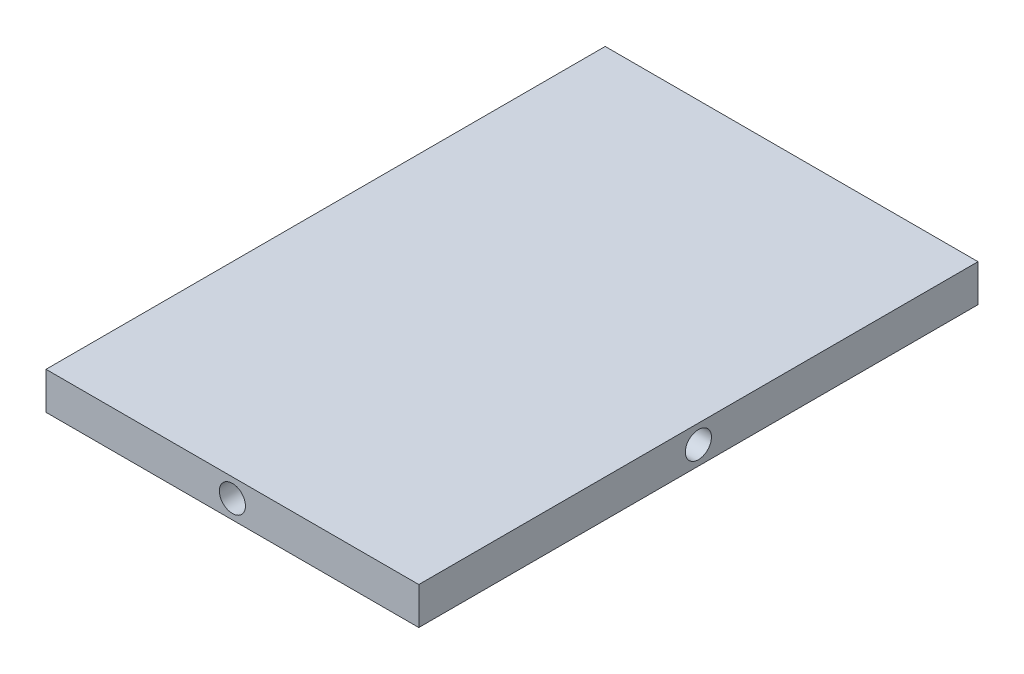
ISO-10303-21;
HEADER;
FILE_DESCRIPTION(('STEP AP214'),'2;1');
FILE_NAME('part.step','',(''),(''),'','','');
FILE_SCHEMA(('AUTOMOTIVE_DESIGN { 1 0 10303 214 1 1 1 1 }'));
ENDSEC;
DATA;
#1=APPLICATION_CONTEXT('core data for automotive mechanical design processes');
#2=APPLICATION_PROTOCOL_DEFINITION('international standard','automotive_design',2000,#1);
#3=PRODUCT_CONTEXT('',#1,'mechanical');
#4=PRODUCT('Part','Part','',(#3));
#5=PRODUCT_RELATED_PRODUCT_CATEGORY('part','',(#4));
#6=PRODUCT_DEFINITION_FORMATION('','',#4);
#7=PRODUCT_DEFINITION_CONTEXT('part definition',#1,'design');
#8=PRODUCT_DEFINITION('design','',#6,#7);
#9=PRODUCT_DEFINITION_SHAPE('','',#8);
#10=(LENGTH_UNIT() NAMED_UNIT(*) SI_UNIT(.MILLI.,.METRE.));
#11=(NAMED_UNIT(*) PLANE_ANGLE_UNIT() SI_UNIT($,.RADIAN.));
#12=(NAMED_UNIT(*) SI_UNIT($,.STERADIAN.) SOLID_ANGLE_UNIT());
#13=UNCERTAINTY_MEASURE_WITH_UNIT(LENGTH_MEASURE(1.E-05),#10,'distance_accuracy_value','');
#14=(GEOMETRIC_REPRESENTATION_CONTEXT(3) GLOBAL_UNCERTAINTY_ASSIGNED_CONTEXT((#13)) GLOBAL_UNIT_ASSIGNED_CONTEXT((#10,
#11,#12)) REPRESENTATION_CONTEXT('',''));
#15=CARTESIAN_POINT('',(0.,0.,0.));
#16=DIRECTION('',(0.,0.,1.));
#17=DIRECTION('',(1.,0.,0.));
#18=AXIS2_PLACEMENT_3D('',#15,#16,#17);
#19=CARTESIAN_POINT('',(50.,10.,75.));
#20=DIRECTION('',(-1.,0.,0.));
#21=DIRECTION('',(0.,0.,1.));
#22=AXIS2_PLACEMENT_3D('',#19,#20,#21);
#23=PLANE('',#22);
#24=CARTESIAN_POINT('',(50.,5.,0.));
#25=DIRECTION('',(1.,0.,0.));
#26=DIRECTION('',(0.,0.,-1.));
#27=AXIS2_PLACEMENT_3D('',#24,#25,#26);
#28=CIRCLE('',#27,3.5);
#29=CARTESIAN_POINT('',(50.,5.,-3.49999999999997));
#30=VERTEX_POINT('',#29);
#31=EDGE_CURVE('E119',#30,#30,#28,.T.);
#32=ORIENTED_EDGE('',*,*,#31,.F.);
#33=EDGE_LOOP('',(#32));
#34=FACE_BOUND('',#33,.T.);
#35=DIRECTION('',(0.,0.,-1.));
#36=VECTOR('',#35,1.);
#37=CARTESIAN_POINT('',(50.,0.,75.));
#38=LINE('',#37,#36);
#39=CARTESIAN_POINT('',(50.,0.,75.));
#40=VERTEX_POINT('',#39);
#41=CARTESIAN_POINT('',(50.,0.,-75.));
#42=VERTEX_POINT('',#41);
#43=EDGE_CURVE('E99',#40,#42,#38,.T.);
#44=ORIENTED_EDGE('',*,*,#43,.T.);
#45=DIRECTION('',(0.,-1.,0.));
#46=VECTOR('',#45,1.);
#47=CARTESIAN_POINT('',(50.,10.,-75.));
#48=LINE('',#47,#46);
#49=CARTESIAN_POINT('',(50.,10.,-75.));
#50=VERTEX_POINT('',#49);
#51=EDGE_CURVE('E11',#50,#42,#48,.T.);
#52=ORIENTED_EDGE('',*,*,#51,.F.);
#53=DIRECTION('',(0.,0.,-1.));
#54=VECTOR('',#53,1.);
#55=CARTESIAN_POINT('',(50.,10.,75.));
#56=LINE('',#55,#54);
#57=CARTESIAN_POINT('',(50.,10.,75.));
#58=VERTEX_POINT('',#57);
#59=EDGE_CURVE('E87',#58,#50,#56,.T.);
#60=ORIENTED_EDGE('',*,*,#59,.F.);
#61=DIRECTION('',(0.,-1.,0.));
#62=VECTOR('',#61,1.);
#63=CARTESIAN_POINT('',(50.,10.,75.));
#64=LINE('',#63,#62);
#65=EDGE_CURVE('E95',#58,#40,#64,.T.);
#66=ORIENTED_EDGE('',*,*,#65,.T.);
#67=EDGE_LOOP('',(#44,#52,#60,#66));
#68=FACE_BOUND('',#67,.T.);
#69=ADVANCED_FACE('F36',(#34,#68),#23,.F.);
#70=CARTESIAN_POINT('',(-50.,10.,-75.));
#71=DIRECTION('',(0.,0.,1.));
#72=DIRECTION('',(1.,0.,0.));
#73=AXIS2_PLACEMENT_3D('',#70,#71,#72);
#74=PLANE('',#73);
#75=CARTESIAN_POINT('',(0.,5.,-75.));
#76=DIRECTION('',(0.,0.,-1.));
#77=DIRECTION('',(-1.,0.,0.));
#78=AXIS2_PLACEMENT_3D('',#75,#76,#77);
#79=CIRCLE('',#78,3.5);
#80=CARTESIAN_POINT('',(-3.5,5.,-75.));
#81=VERTEX_POINT('',#80);
#82=EDGE_CURVE('E125',#81,#81,#79,.T.);
#83=ORIENTED_EDGE('',*,*,#82,.F.);
#84=EDGE_LOOP('',(#83));
#85=FACE_BOUND('',#84,.T.);
#86=DIRECTION('',(-1.,0.,0.));
#87=VECTOR('',#86,1.);
#88=CARTESIAN_POINT('',(-50.,0.,-75.));
#89=LINE('',#88,#87);
#90=CARTESIAN_POINT('',(-50.,0.,-75.));
#91=VERTEX_POINT('',#90);
#92=EDGE_CURVE('E91',#42,#91,#89,.T.);
#93=ORIENTED_EDGE('',*,*,#92,.T.);
#94=DIRECTION('',(0.,-1.,0.));
#95=VECTOR('',#94,1.);
#96=CARTESIAN_POINT('',(-50.,10.,-75.));
#97=LINE('',#96,#95);
#98=CARTESIAN_POINT('',(-50.,10.,-75.));
#99=VERTEX_POINT('',#98);
#100=EDGE_CURVE('E44',#99,#91,#97,.T.);
#101=ORIENTED_EDGE('',*,*,#100,.F.);
#102=DIRECTION('',(-1.,0.,0.));
#103=VECTOR('',#102,1.);
#104=CARTESIAN_POINT('',(-50.,10.,-75.));
#105=LINE('',#104,#103);
#106=EDGE_CURVE('E82',#50,#99,#105,.T.);
#107=ORIENTED_EDGE('',*,*,#106,.F.);
#108=ORIENTED_EDGE('',*,*,#51,.T.);
#109=EDGE_LOOP('',(#93,#101,#107,#108));
#110=FACE_BOUND('',#109,.T.);
#111=ADVANCED_FACE('F90',(#85,#110),#74,.F.);
#112=CARTESIAN_POINT('',(-50.,10.,75.));
#113=DIRECTION('',(1.,0.,0.));
#114=DIRECTION('',(0.,0.,-1.));
#115=AXIS2_PLACEMENT_3D('',#112,#113,#114);
#116=PLANE('',#115);
#117=CARTESIAN_POINT('',(-50.,5.,0.));
#118=DIRECTION('',(-1.,0.,0.));
#119=DIRECTION('',(0.,0.,1.));
#120=AXIS2_PLACEMENT_3D('',#117,#118,#119);
#121=CIRCLE('',#120,3.5);
#122=CARTESIAN_POINT('',(-50.,5.,3.49999999999997));
#123=VERTEX_POINT('',#122);
#124=EDGE_CURVE('E131',#123,#123,#121,.T.);
#125=ORIENTED_EDGE('',*,*,#124,.F.);
#126=EDGE_LOOP('',(#125));
#127=FACE_BOUND('',#126,.T.);
#128=DIRECTION('',(0.,0.,1.));
#129=VECTOR('',#128,1.);
#130=CARTESIAN_POINT('',(-50.,0.,75.));
#131=LINE('',#130,#129);
#132=CARTESIAN_POINT('',(-50.,0.,75.));
#133=VERTEX_POINT('',#132);
#134=EDGE_CURVE('E69',#91,#133,#131,.T.);
#135=ORIENTED_EDGE('',*,*,#134,.T.);
#136=DIRECTION('',(0.,-1.,0.));
#137=VECTOR('',#136,1.);
#138=CARTESIAN_POINT('',(-50.,10.,75.));
#139=LINE('',#138,#137);
#140=CARTESIAN_POINT('',(-50.,10.,75.));
#141=VERTEX_POINT('',#140);
#142=EDGE_CURVE('E92',#141,#133,#139,.T.);
#143=ORIENTED_EDGE('',*,*,#142,.F.);
#144=DIRECTION('',(0.,0.,1.));
#145=VECTOR('',#144,1.);
#146=CARTESIAN_POINT('',(-50.,10.,75.));
#147=LINE('',#146,#145);
#148=EDGE_CURVE('E85',#99,#141,#147,.T.);
#149=ORIENTED_EDGE('',*,*,#148,.F.);
#150=ORIENTED_EDGE('',*,*,#100,.T.);
#151=EDGE_LOOP('',(#135,#143,#149,#150));
#152=FACE_BOUND('',#151,.T.);
#153=ADVANCED_FACE('F93',(#127,#152),#116,.F.);
#154=CARTESIAN_POINT('',(-50.,10.,75.));
#155=DIRECTION('',(0.,0.,-1.));
#156=DIRECTION('',(-1.,0.,0.));
#157=AXIS2_PLACEMENT_3D('',#154,#155,#156);
#158=PLANE('',#157);
#159=CARTESIAN_POINT('',(0.,5.,75.));
#160=DIRECTION('',(0.,0.,1.));
#161=DIRECTION('',(1.,0.,0.));
#162=AXIS2_PLACEMENT_3D('',#159,#160,#161);
#163=CIRCLE('',#162,3.5);
#164=CARTESIAN_POINT('',(3.50000000000003,5.,75.));
#165=VERTEX_POINT('',#164);
#166=EDGE_CURVE('E113',#165,#165,#163,.T.);
#167=ORIENTED_EDGE('',*,*,#166,.F.);
#168=EDGE_LOOP('',(#167));
#169=FACE_BOUND('',#168,.T.);
#170=DIRECTION('',(1.,0.,0.));
#171=VECTOR('',#170,1.);
#172=CARTESIAN_POINT('',(-50.,0.,75.));
#173=LINE('',#172,#171);
#174=EDGE_CURVE('E75',#133,#40,#173,.T.);
#175=ORIENTED_EDGE('',*,*,#174,.T.);
#176=ORIENTED_EDGE('',*,*,#65,.F.);
#177=DIRECTION('',(1.,0.,0.));
#178=VECTOR('',#177,1.);
#179=CARTESIAN_POINT('',(-50.,10.,75.));
#180=LINE('',#179,#178);
#181=EDGE_CURVE('E52',#141,#58,#180,.T.);
#182=ORIENTED_EDGE('',*,*,#181,.F.);
#183=ORIENTED_EDGE('',*,*,#142,.T.);
#184=EDGE_LOOP('',(#175,#176,#182,#183));
#185=FACE_BOUND('',#184,.T.);
#186=ADVANCED_FACE('F107',(#169,#185),#158,.F.);
#187=CARTESIAN_POINT('',(0.,10.,0.));
#188=DIRECTION('',(0.,-1.,0.));
#189=DIRECTION('',(0.,0.,-1.));
#190=AXIS2_PLACEMENT_3D('',#187,#188,#189);
#191=PLANE('',#190);
#192=ORIENTED_EDGE('',*,*,#59,.T.);
#193=ORIENTED_EDGE('',*,*,#106,.T.);
#194=ORIENTED_EDGE('',*,*,#148,.T.);
#195=ORIENTED_EDGE('',*,*,#181,.T.);
#196=EDGE_LOOP('',(#192,#193,#194,#195));
#197=FACE_BOUND('',#196,.T.);
#198=ADVANCED_FACE('F83',(#197),#191,.F.);
#199=CARTESIAN_POINT('',(0.,0.,0.));
#200=DIRECTION('',(0.,-1.,0.));
#201=DIRECTION('',(0.,0.,-1.));
#202=AXIS2_PLACEMENT_3D('',#199,#200,#201);
#203=PLANE('',#202);
#204=ORIENTED_EDGE('',*,*,#43,.F.);
#205=ORIENTED_EDGE('',*,*,#174,.F.);
#206=ORIENTED_EDGE('',*,*,#134,.F.);
#207=ORIENTED_EDGE('',*,*,#92,.F.);
#208=EDGE_LOOP('',(#204,#205,#206,#207));
#209=FACE_BOUND('',#208,.T.);
#210=ADVANCED_FACE('F110',(#209),#203,.T.);
#211=CARTESIAN_POINT('',(0.,5.,65.));
#212=DIRECTION('',(0.,0.,1.));
#213=DIRECTION('',(1.,0.,0.));
#214=AXIS2_PLACEMENT_3D('',#211,#212,#213);
#215=CYLINDRICAL_SURFACE('',#214,3.5);
#216=CARTESIAN_POINT('',(0.,5.,65.));
#217=DIRECTION('',(0.,0.,1.));
#218=DIRECTION('',(1.,0.,0.));
#219=AXIS2_PLACEMENT_3D('',#216,#217,#218);
#220=CIRCLE('',#219,3.5);
#221=CARTESIAN_POINT('',(3.50000000000003,5.,65.));
#222=VERTEX_POINT('',#221);
#223=EDGE_CURVE('E102',#222,#222,#220,.T.);
#224=ORIENTED_EDGE('',*,*,#223,.F.);
#225=EDGE_LOOP('',(#224));
#226=FACE_BOUND('',#225,.T.);
#227=ORIENTED_EDGE('',*,*,#166,.T.);
#228=EDGE_LOOP('',(#227));
#229=FACE_BOUND('',#228,.T.);
#230=ADVANCED_FACE('F174',(#226,#229),#215,.F.);
#231=CARTESIAN_POINT('',(0.,5.,65.));
#232=DIRECTION('',(0.,0.,1.));
#233=DIRECTION('',(1.,0.,0.));
#234=AXIS2_PLACEMENT_3D('',#231,#232,#233);
#235=PLANE('',#234);
#236=ORIENTED_EDGE('',*,*,#223,.T.);
#237=EDGE_LOOP('',(#236));
#238=FACE_BOUND('',#237,.T.);
#239=ADVANCED_FACE('F164',(#238),#235,.T.);
#240=CARTESIAN_POINT('',(40.,5.,0.));
#241=DIRECTION('',(1.,0.,0.));
#242=DIRECTION('',(0.,0.,-1.));
#243=AXIS2_PLACEMENT_3D('',#240,#241,#242);
#244=CYLINDRICAL_SURFACE('',#243,3.5);
#245=CARTESIAN_POINT('',(40.,5.,0.));
#246=DIRECTION('',(1.,0.,0.));
#247=DIRECTION('',(0.,0.,-1.));
#248=AXIS2_PLACEMENT_3D('',#245,#246,#247);
#249=CIRCLE('',#248,3.5);
#250=CARTESIAN_POINT('',(40.,5.,-3.49999999999997));
#251=VERTEX_POINT('',#250);
#252=EDGE_CURVE('E116',#251,#251,#249,.T.);
#253=ORIENTED_EDGE('',*,*,#252,.F.);
#254=EDGE_LOOP('',(#253));
#255=FACE_BOUND('',#254,.T.);
#256=ORIENTED_EDGE('',*,*,#31,.T.);
#257=EDGE_LOOP('',(#256));
#258=FACE_BOUND('',#257,.T.);
#259=ADVANCED_FACE('F161',(#255,#258),#244,.F.);
#260=CARTESIAN_POINT('',(40.,5.,0.));
#261=DIRECTION('',(1.,0.,0.));
#262=DIRECTION('',(0.,0.,-1.));
#263=AXIS2_PLACEMENT_3D('',#260,#261,#262);
#264=PLANE('',#263);
#265=ORIENTED_EDGE('',*,*,#252,.T.);
#266=EDGE_LOOP('',(#265));
#267=FACE_BOUND('',#266,.T.);
#268=ADVANCED_FACE('F163',(#267),#264,.T.);
#269=CARTESIAN_POINT('',(0.,5.,-65.));
#270=DIRECTION('',(0.,0.,-1.));
#271=DIRECTION('',(-1.,0.,0.));
#272=AXIS2_PLACEMENT_3D('',#269,#270,#271);
#273=CYLINDRICAL_SURFACE('',#272,3.5);
#274=CARTESIAN_POINT('',(0.,5.,-65.));
#275=DIRECTION('',(0.,0.,-1.));
#276=DIRECTION('',(-1.,0.,0.));
#277=AXIS2_PLACEMENT_3D('',#274,#275,#276);
#278=CIRCLE('',#277,3.5);
#279=CARTESIAN_POINT('',(-3.5,5.,-65.));
#280=VERTEX_POINT('',#279);
#281=EDGE_CURVE('E122',#280,#280,#278,.T.);
#282=ORIENTED_EDGE('',*,*,#281,.F.);
#283=EDGE_LOOP('',(#282));
#284=FACE_BOUND('',#283,.T.);
#285=ORIENTED_EDGE('',*,*,#82,.T.);
#286=EDGE_LOOP('',(#285));
#287=FACE_BOUND('',#286,.T.);
#288=ADVANCED_FACE('F171',(#284,#287),#273,.F.);
#289=CARTESIAN_POINT('',(0.,0.,-65.));
#290=DIRECTION('',(0.,0.,-1.));
#291=DIRECTION('',(-1.,0.,0.));
#292=AXIS2_PLACEMENT_3D('',#289,#290,#291);
#293=PLANE('',#292);
#294=ORIENTED_EDGE('',*,*,#281,.T.);
#295=EDGE_LOOP('',(#294));
#296=FACE_BOUND('',#295,.T.);
#297=ADVANCED_FACE('F142',(#296),#293,.T.);
#298=CARTESIAN_POINT('',(-40.,5.,0.));
#299=DIRECTION('',(-1.,0.,0.));
#300=DIRECTION('',(0.,0.,1.));
#301=AXIS2_PLACEMENT_3D('',#298,#299,#300);
#302=CYLINDRICAL_SURFACE('',#301,3.5);
#303=CARTESIAN_POINT('',(-40.,5.,0.));
#304=DIRECTION('',(-1.,0.,0.));
#305=DIRECTION('',(0.,0.,1.));
#306=AXIS2_PLACEMENT_3D('',#303,#304,#305);
#307=CIRCLE('',#306,3.5);
#308=CARTESIAN_POINT('',(-40.,5.,3.49999999999997));
#309=VERTEX_POINT('',#308);
#310=EDGE_CURVE('E128',#309,#309,#307,.T.);
#311=ORIENTED_EDGE('',*,*,#310,.F.);
#312=EDGE_LOOP('',(#311));
#313=FACE_BOUND('',#312,.T.);
#314=ORIENTED_EDGE('',*,*,#124,.T.);
#315=EDGE_LOOP('',(#314));
#316=FACE_BOUND('',#315,.T.);
#317=ADVANCED_FACE('F139',(#313,#316),#302,.F.);
#318=CARTESIAN_POINT('',(-40.,5.,0.));
#319=DIRECTION('',(-1.,0.,0.));
#320=DIRECTION('',(0.,0.,1.));
#321=AXIS2_PLACEMENT_3D('',#318,#319,#320);
#322=PLANE('',#321);
#323=ORIENTED_EDGE('',*,*,#310,.T.);
#324=EDGE_LOOP('',(#323));
#325=FACE_BOUND('',#324,.T.);
#326=ADVANCED_FACE('F137',(#325),#322,.T.);
#327=CLOSED_SHELL('',(#69,#111,#153,#186,#198,#210,#230,#239,#259,#268,#288,#297,#317,#326));
#328=MANIFOLD_SOLID_BREP('B2',#327);
#329=ADVANCED_BREP_SHAPE_REPRESENTATION('',(#18,#328),#14);
#330=SHAPE_DEFINITION_REPRESENTATION(#9,#329);
ENDSEC;
END-ISO-10303-21;
